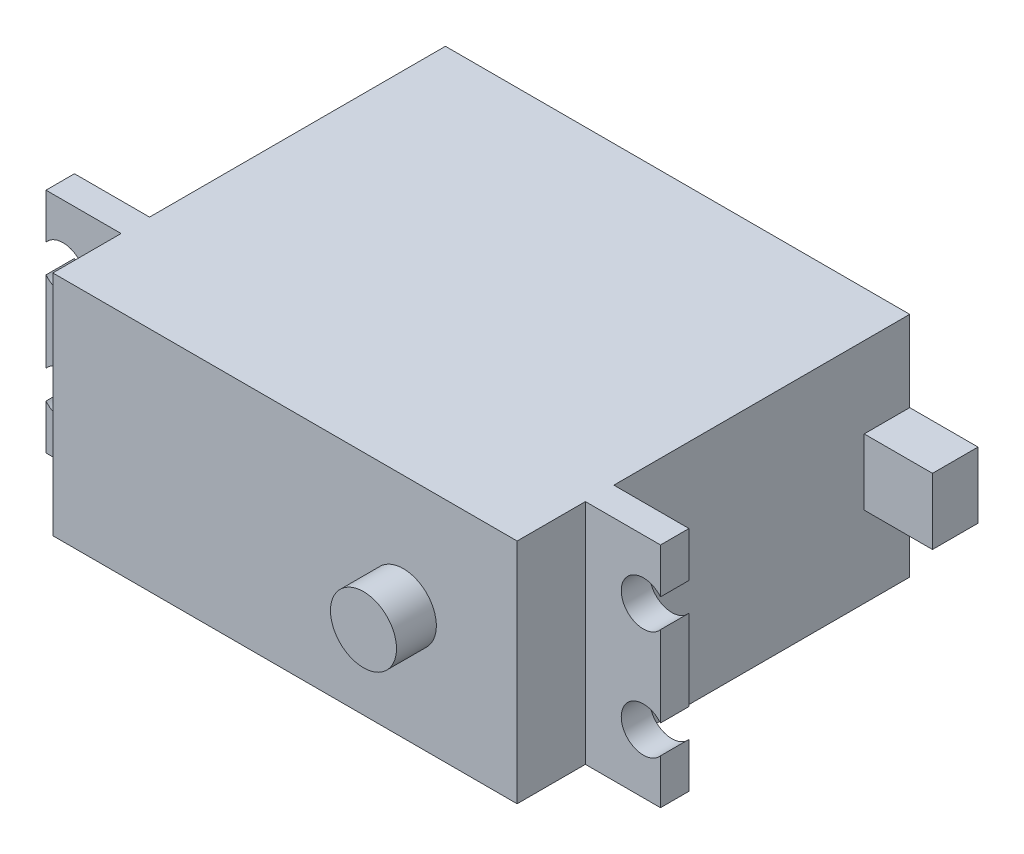
ISO-10303-21;
HEADER;
FILE_DESCRIPTION(('STEP AP214'),'2;1');
FILE_NAME('part.step','',(''),(''),'','','');
FILE_SCHEMA(('AUTOMOTIVE_DESIGN { 1 0 10303 214 1 1 1 1 }'));
ENDSEC;
DATA;
#1=APPLICATION_CONTEXT('core data for automotive mechanical design processes');
#2=APPLICATION_PROTOCOL_DEFINITION('international standard','automotive_design',2000,#1);
#3=PRODUCT_CONTEXT('',#1,'mechanical');
#4=PRODUCT('Part','Part','',(#3));
#5=PRODUCT_RELATED_PRODUCT_CATEGORY('part','',(#4));
#6=PRODUCT_DEFINITION_FORMATION('','',#4);
#7=PRODUCT_DEFINITION_CONTEXT('part definition',#1,'design');
#8=PRODUCT_DEFINITION('design','',#6,#7);
#9=PRODUCT_DEFINITION_SHAPE('','',#8);
#10=(LENGTH_UNIT() NAMED_UNIT(*) SI_UNIT(.MILLI.,.METRE.));
#11=(NAMED_UNIT(*) PLANE_ANGLE_UNIT() SI_UNIT($,.RADIAN.));
#12=(NAMED_UNIT(*) SI_UNIT($,.STERADIAN.) SOLID_ANGLE_UNIT());
#13=UNCERTAINTY_MEASURE_WITH_UNIT(LENGTH_MEASURE(1.E-05),#10,'distance_accuracy_value','');
#14=(GEOMETRIC_REPRESENTATION_CONTEXT(3) GLOBAL_UNCERTAINTY_ASSIGNED_CONTEXT((#13)) GLOBAL_UNIT_ASSIGNED_CONTEXT((#10,
#11,#12)) REPRESENTATION_CONTEXT('',''));
#15=CARTESIAN_POINT('',(0.,0.,0.));
#16=DIRECTION('',(0.,0.,1.));
#17=DIRECTION('',(1.,0.,0.));
#18=AXIS2_PLACEMENT_3D('',#15,#16,#17);
#19=CARTESIAN_POINT('',(20.4,-10.,-26.));
#20=DIRECTION('',(-1.,0.,0.));
#21=DIRECTION('',(0.,0.,1.));
#22=AXIS2_PLACEMENT_3D('',#19,#20,#21);
#23=PLANE('',#22);
#24=DIRECTION('',(0.,0.,1.));
#25=VECTOR('',#24,1.);
#26=CARTESIAN_POINT('',(20.4,2.9,-22.));
#27=LINE('',#26,#25);
#28=CARTESIAN_POINT('',(20.4,2.9,-26.));
#29=VERTEX_POINT('',#28);
#30=CARTESIAN_POINT('',(20.4,2.9,-22.));
#31=VERTEX_POINT('',#30);
#32=EDGE_CURVE('E706',#29,#31,#27,.T.);
#33=ORIENTED_EDGE('',*,*,#32,.F.);
#34=DIRECTION('',(0.,-1.,0.));
#35=VECTOR('',#34,1.);
#36=CARTESIAN_POINT('',(20.4,-10.,-26.));
#37=LINE('',#36,#35);
#38=CARTESIAN_POINT('',(20.4,10.,-26.));
#39=VERTEX_POINT('',#38);
#40=EDGE_CURVE('E215',#39,#29,#37,.T.);
#41=ORIENTED_EDGE('',*,*,#40,.F.);
#42=DIRECTION('',(0.,0.,1.));
#43=VECTOR('',#42,1.);
#44=CARTESIAN_POINT('',(20.4,10.,-26.));
#45=LINE('',#44,#43);
#46=CARTESIAN_POINT('',(20.4,10.,0.));
#47=VERTEX_POINT('',#46);
#48=EDGE_CURVE('E252',#39,#47,#45,.T.);
#49=ORIENTED_EDGE('',*,*,#48,.T.);
#50=DIRECTION('',(0.,-1.,0.));
#51=VECTOR('',#50,1.);
#52=CARTESIAN_POINT('',(20.4,-10.,0.));
#53=LINE('',#52,#51);
#54=CARTESIAN_POINT('',(20.4,-10.,0.));
#55=VERTEX_POINT('',#54);
#56=EDGE_CURVE('E228',#47,#55,#53,.T.);
#57=ORIENTED_EDGE('',*,*,#56,.T.);
#58=DIRECTION('',(0.,0.,1.));
#59=VECTOR('',#58,1.);
#60=CARTESIAN_POINT('',(20.4,-10.,-26.));
#61=LINE('',#60,#59);
#62=CARTESIAN_POINT('',(20.4,-10.,-26.));
#63=VERTEX_POINT('',#62);
#64=EDGE_CURVE('E246',#63,#55,#61,.T.);
#65=ORIENTED_EDGE('',*,*,#64,.F.);
#66=CARTESIAN_POINT('',(20.4,-2.9,-26.));
#67=VERTEX_POINT('',#66);
#68=EDGE_CURVE('E230',#67,#63,#37,.T.);
#69=ORIENTED_EDGE('',*,*,#68,.F.);
#70=DIRECTION('',(0.,0.,-1.));
#71=VECTOR('',#70,1.);
#72=CARTESIAN_POINT('',(20.4,-2.9,-22.));
#73=LINE('',#72,#71);
#74=CARTESIAN_POINT('',(20.4,-2.9,-22.));
#75=VERTEX_POINT('',#74);
#76=EDGE_CURVE('E209',#75,#67,#73,.T.);
#77=ORIENTED_EDGE('',*,*,#76,.F.);
#78=DIRECTION('',(0.,-1.,0.));
#79=VECTOR('',#78,1.);
#80=CARTESIAN_POINT('',(20.4,2.9,-22.));
#81=LINE('',#80,#79);
#82=EDGE_CURVE('E704',#31,#75,#81,.T.);
#83=ORIENTED_EDGE('',*,*,#82,.F.);
#84=EDGE_LOOP('',(#33,#41,#49,#57,#65,#69,#77,#83));
#85=FACE_BOUND('',#84,.T.);
#86=ADVANCED_FACE('F32',(#85),#23,.F.);
#87=CARTESIAN_POINT('',(20.4,10.,8.5));
#88=DIRECTION('',(0.,0.,-1.));
#89=DIRECTION('',(-1.,0.,0.));
#90=AXIS2_PLACEMENT_3D('',#87,#88,#89);
#91=PLANE('',#90);
#92=DIRECTION('',(0.,1.,0.));
#93=VECTOR('',#92,1.);
#94=CARTESIAN_POINT('',(20.4,-10.,8.5));
#95=LINE('',#94,#93);
#96=CARTESIAN_POINT('',(20.4,-10.,8.5));
#97=VERTEX_POINT('',#96);
#98=CARTESIAN_POINT('',(20.4,10.,8.5));
#99=VERTEX_POINT('',#98);
#100=EDGE_CURVE('E276',#97,#99,#95,.T.);
#101=ORIENTED_EDGE('',*,*,#100,.T.);
#102=DIRECTION('',(-1.,0.,0.));
#103=VECTOR('',#102,1.);
#104=CARTESIAN_POINT('',(-20.4,10.,8.5));
#105=LINE('',#104,#103);
#106=CARTESIAN_POINT('',(-20.4,10.,8.5));
#107=VERTEX_POINT('',#106);
#108=EDGE_CURVE('E470',#99,#107,#105,.T.);
#109=ORIENTED_EDGE('',*,*,#108,.T.);
#110=DIRECTION('',(0.,-1.,0.));
#111=VECTOR('',#110,1.);
#112=CARTESIAN_POINT('',(-20.4,-10.,8.5));
#113=LINE('',#112,#111);
#114=CARTESIAN_POINT('',(-20.4,-10.,8.5));
#115=VERTEX_POINT('',#114);
#116=EDGE_CURVE('E438',#107,#115,#113,.T.);
#117=ORIENTED_EDGE('',*,*,#116,.T.);
#118=DIRECTION('',(1.,0.,0.));
#119=VECTOR('',#118,1.);
#120=CARTESIAN_POINT('',(-20.4,-10.,8.5));
#121=LINE('',#120,#119);
#122=EDGE_CURVE('E288',#115,#97,#121,.T.);
#123=ORIENTED_EDGE('',*,*,#122,.T.);
#124=EDGE_LOOP('',(#101,#109,#117,#123));
#125=FACE_BOUND('',#124,.T.);
#126=CARTESIAN_POINT('',(10.4,0.,8.5));
#127=DIRECTION('',(0.,0.,-1.));
#128=DIRECTION('',(-1.,0.,0.));
#129=AXIS2_PLACEMENT_3D('',#126,#127,#128);
#130=CIRCLE('',#129,2.9);
#131=CARTESIAN_POINT('',(7.5,0.,8.5));
#132=VERTEX_POINT('',#131);
#133=EDGE_CURVE('E11',#132,#132,#130,.F.);
#134=ORIENTED_EDGE('',*,*,#133,.F.);
#135=EDGE_LOOP('',(#134));
#136=FACE_BOUND('',#135,.T.);
#137=ADVANCED_FACE('F472',(#125,#136),#91,.F.);
#138=CARTESIAN_POINT('',(27.,10.,0.));
#139=DIRECTION('',(0.,0.,-1.));
#140=DIRECTION('',(-1.,0.,0.));
#141=AXIS2_PLACEMENT_3D('',#138,#139,#140);
#142=PLANE('',#141);
#143=DIRECTION('',(0.,1.,0.));
#144=VECTOR('',#143,1.);
#145=CARTESIAN_POINT('',(-20.4,-10.,0.));
#146=LINE('',#145,#144);
#147=CARTESIAN_POINT('',(-20.4,-10.,0.));
#148=VERTEX_POINT('',#147);
#149=CARTESIAN_POINT('',(-20.4,10.,0.));
#150=VERTEX_POINT('',#149);
#151=EDGE_CURVE('E219',#148,#150,#146,.T.);
#152=ORIENTED_EDGE('',*,*,#151,.F.);
#153=DIRECTION('',(1.,0.,0.));
#154=VECTOR('',#153,1.);
#155=CARTESIAN_POINT('',(-27.,-10.,0.));
#156=LINE('',#155,#154);
#157=CARTESIAN_POINT('',(-27.,-10.,0.));
#158=VERTEX_POINT('',#157);
#159=EDGE_CURVE('E393',#158,#148,#156,.T.);
#160=ORIENTED_EDGE('',*,*,#159,.F.);
#161=DIRECTION('',(0.,-1.,0.));
#162=VECTOR('',#161,1.);
#163=CARTESIAN_POINT('',(-27.,-10.,0.));
#164=LINE('',#163,#162);
#165=CARTESIAN_POINT('',(-27.,-6.04599357943772,0.));
#166=VERTEX_POINT('',#165);
#167=EDGE_CURVE('E400',#166,#158,#164,.T.);
#168=ORIENTED_EDGE('',*,*,#167,.F.);
#169=CARTESIAN_POINT('',(-25.5,-4.8,0.));
#170=DIRECTION('',(0.,0.,-1.));
#171=DIRECTION('',(-1.,0.,0.));
#172=AXIS2_PLACEMENT_3D('',#169,#170,#171);
#173=CIRCLE('',#172,1.95);
#174=CARTESIAN_POINT('',(-27.,-3.55400642056228,0.));
#175=VERTEX_POINT('',#174);
#176=EDGE_CURVE('E332',#166,#175,#173,.F.);
#177=ORIENTED_EDGE('',*,*,#176,.T.);
#178=CARTESIAN_POINT('',(-27.,3.55400642056228,0.));
#179=VERTEX_POINT('',#178);
#180=EDGE_CURVE('E399',#179,#175,#164,.T.);
#181=ORIENTED_EDGE('',*,*,#180,.F.);
#182=CARTESIAN_POINT('',(-25.5,4.8,0.));
#183=DIRECTION('',(0.,0.,-1.));
#184=DIRECTION('',(-1.,0.,0.));
#185=AXIS2_PLACEMENT_3D('',#182,#183,#184);
#186=CIRCLE('',#185,1.95);
#187=CARTESIAN_POINT('',(-27.,6.04599357943772,0.));
#188=VERTEX_POINT('',#187);
#189=EDGE_CURVE('E343',#179,#188,#186,.F.);
#190=ORIENTED_EDGE('',*,*,#189,.T.);
#191=CARTESIAN_POINT('',(-27.,10.,0.));
#192=VERTEX_POINT('',#191);
#193=EDGE_CURVE('E386',#192,#188,#164,.T.);
#194=ORIENTED_EDGE('',*,*,#193,.F.);
#195=DIRECTION('',(-1.,0.,0.));
#196=VECTOR('',#195,1.);
#197=CARTESIAN_POINT('',(-27.,10.,0.));
#198=LINE('',#197,#196);
#199=EDGE_CURVE('E55',#150,#192,#198,.T.);
#200=ORIENTED_EDGE('',*,*,#199,.F.);
#201=EDGE_LOOP('',(#152,#160,#168,#177,#181,#190,#194,#200));
#202=FACE_BOUND('',#201,.T.);
#203=ADVANCED_FACE('F447',(#202),#142,.T.);
#204=CARTESIAN_POINT('',(27.,10.,2.5));
#205=DIRECTION('',(0.,0.,-1.));
#206=DIRECTION('',(-1.,0.,0.));
#207=AXIS2_PLACEMENT_3D('',#204,#205,#206);
#208=PLANE('',#207);
#209=DIRECTION('',(0.,1.,0.));
#210=VECTOR('',#209,1.);
#211=CARTESIAN_POINT('',(20.4,-10.,2.5));
#212=LINE('',#211,#210);
#213=CARTESIAN_POINT('',(20.4,-10.,2.5));
#214=VERTEX_POINT('',#213);
#215=CARTESIAN_POINT('',(20.4,10.,2.5));
#216=VERTEX_POINT('',#215);
#217=EDGE_CURVE('E266',#214,#216,#212,.T.);
#218=ORIENTED_EDGE('',*,*,#217,.F.);
#219=DIRECTION('',(1.,0.,0.));
#220=VECTOR('',#219,1.);
#221=CARTESIAN_POINT('',(-27.,-10.,2.5));
#222=LINE('',#221,#220);
#223=CARTESIAN_POINT('',(27.,-10.,2.5));
#224=VERTEX_POINT('',#223);
#225=EDGE_CURVE('E296',#214,#224,#222,.T.);
#226=ORIENTED_EDGE('',*,*,#225,.T.);
#227=DIRECTION('',(0.,1.,0.));
#228=VECTOR('',#227,1.);
#229=CARTESIAN_POINT('',(27.,-10.,2.5));
#230=LINE('',#229,#228);
#231=CARTESIAN_POINT('',(27.,-6.04599357943771,2.5));
#232=VERTEX_POINT('',#231);
#233=EDGE_CURVE('E353',#224,#232,#230,.T.);
#234=ORIENTED_EDGE('',*,*,#233,.T.);
#235=CARTESIAN_POINT('',(25.5,-4.79999999999999,2.5));
#236=DIRECTION('',(0.,0.,1.));
#237=DIRECTION('',(1.,0.,0.));
#238=AXIS2_PLACEMENT_3D('',#235,#236,#237);
#239=CIRCLE('',#238,1.95);
#240=CARTESIAN_POINT('',(27.,-3.55400642056227,2.5));
#241=VERTEX_POINT('',#240);
#242=EDGE_CURVE('E320',#241,#232,#239,.T.);
#243=ORIENTED_EDGE('',*,*,#242,.F.);
#244=CARTESIAN_POINT('',(27.,3.5540064205623,2.5));
#245=VERTEX_POINT('',#244);
#246=EDGE_CURVE('E357',#241,#245,#230,.T.);
#247=ORIENTED_EDGE('',*,*,#246,.T.);
#248=CARTESIAN_POINT('',(25.5,4.80000000000001,2.5));
#249=DIRECTION('',(0.,0.,1.));
#250=DIRECTION('',(-1.,0.,0.));
#251=AXIS2_PLACEMENT_3D('',#248,#249,#250);
#252=CIRCLE('',#251,1.95);
#253=CARTESIAN_POINT('',(27.,6.04599357943772,2.5));
#254=VERTEX_POINT('',#253);
#255=EDGE_CURVE('E292',#254,#245,#252,.T.);
#256=ORIENTED_EDGE('',*,*,#255,.F.);
#257=CARTESIAN_POINT('',(27.,10.,2.5));
#258=VERTEX_POINT('',#257);
#259=EDGE_CURVE('E358',#254,#258,#230,.T.);
#260=ORIENTED_EDGE('',*,*,#259,.T.);
#261=DIRECTION('',(-1.,0.,0.));
#262=VECTOR('',#261,1.);
#263=CARTESIAN_POINT('',(-27.,10.,2.5));
#264=LINE('',#263,#262);
#265=EDGE_CURVE('E365',#258,#216,#264,.T.);
#266=ORIENTED_EDGE('',*,*,#265,.T.);
#267=EDGE_LOOP('',(#218,#226,#234,#243,#247,#256,#260,#266));
#268=FACE_BOUND('',#267,.T.);
#269=ADVANCED_FACE('F513',(#268),#208,.F.);
#270=DIRECTION('',(0.,-1.,0.));
#271=VECTOR('',#270,1.);
#272=CARTESIAN_POINT('',(-20.4,-10.,2.5));
#273=LINE('',#272,#271);
#274=CARTESIAN_POINT('',(-20.4,10.,2.5));
#275=VERTEX_POINT('',#274);
#276=CARTESIAN_POINT('',(-20.4,-10.,2.5));
#277=VERTEX_POINT('',#276);
#278=EDGE_CURVE('E270',#275,#277,#273,.T.);
#279=ORIENTED_EDGE('',*,*,#278,.F.);
#280=CARTESIAN_POINT('',(-27.,10.,2.5));
#281=VERTEX_POINT('',#280);
#282=EDGE_CURVE('E356',#275,#281,#264,.T.);
#283=ORIENTED_EDGE('',*,*,#282,.T.);
#284=DIRECTION('',(0.,-1.,0.));
#285=VECTOR('',#284,1.);
#286=CARTESIAN_POINT('',(-27.,-10.,2.5));
#287=LINE('',#286,#285);
#288=CARTESIAN_POINT('',(-27.,6.04599357943772,2.5));
#289=VERTEX_POINT('',#288);
#290=EDGE_CURVE('E361',#281,#289,#287,.T.);
#291=ORIENTED_EDGE('',*,*,#290,.T.);
#292=CARTESIAN_POINT('',(-25.5,4.8,2.5));
#293=DIRECTION('',(0.,0.,1.));
#294=DIRECTION('',(1.,0.,0.));
#295=AXIS2_PLACEMENT_3D('',#292,#293,#294);
#296=CIRCLE('',#295,1.95);
#297=CARTESIAN_POINT('',(-27.,3.55400642056228,2.5));
#298=VERTEX_POINT('',#297);
#299=EDGE_CURVE('E341',#298,#289,#296,.T.);
#300=ORIENTED_EDGE('',*,*,#299,.F.);
#301=CARTESIAN_POINT('',(-27.,-3.55400642056228,2.5));
#302=VERTEX_POINT('',#301);
#303=EDGE_CURVE('E423',#298,#302,#287,.T.);
#304=ORIENTED_EDGE('',*,*,#303,.T.);
#305=CARTESIAN_POINT('',(-25.5,-4.8,2.5));
#306=DIRECTION('',(0.,0.,1.));
#307=DIRECTION('',(-1.,0.,0.));
#308=AXIS2_PLACEMENT_3D('',#305,#306,#307);
#309=CIRCLE('',#308,1.95);
#310=CARTESIAN_POINT('',(-27.,-6.04599357943772,2.5));
#311=VERTEX_POINT('',#310);
#312=EDGE_CURVE('E330',#311,#302,#309,.T.);
#313=ORIENTED_EDGE('',*,*,#312,.F.);
#314=CARTESIAN_POINT('',(-27.,-10.,2.5));
#315=VERTEX_POINT('',#314);
#316=EDGE_CURVE('E367',#311,#315,#287,.T.);
#317=ORIENTED_EDGE('',*,*,#316,.T.);
#318=EDGE_CURVE('E383',#315,#277,#222,.T.);
#319=ORIENTED_EDGE('',*,*,#318,.T.);
#320=EDGE_LOOP('',(#279,#283,#291,#300,#304,#313,#317,#319));
#321=FACE_BOUND('',#320,.T.);
#322=ADVANCED_FACE('F429',(#321),#208,.F.);
#323=CARTESIAN_POINT('',(27.,-10.,2.5));
#324=DIRECTION('',(-1.,0.,0.));
#325=DIRECTION('',(0.,0.,1.));
#326=AXIS2_PLACEMENT_3D('',#323,#324,#325);
#327=PLANE('',#326);
#328=DIRECTION('',(0.,1.,0.));
#329=VECTOR('',#328,1.);
#330=CARTESIAN_POINT('',(27.,-10.,0.));
#331=LINE('',#330,#329);
#332=CARTESIAN_POINT('',(27.,-3.55400642056227,0.));
#333=VERTEX_POINT('',#332);
#334=CARTESIAN_POINT('',(27.,3.5540064205623,0.));
#335=VERTEX_POINT('',#334);
#336=EDGE_CURVE('E415',#333,#335,#331,.T.);
#337=ORIENTED_EDGE('',*,*,#336,.T.);
#338=DIRECTION('',(0.,0.,1.));
#339=VECTOR('',#338,1.);
#340=CARTESIAN_POINT('',(27.,3.5540064205623,-5.51543289325507));
#341=LINE('',#340,#339);
#342=EDGE_CURVE('E316',#335,#245,#341,.T.);
#343=ORIENTED_EDGE('',*,*,#342,.T.);
#344=ORIENTED_EDGE('',*,*,#246,.F.);
#345=DIRECTION('',(0.,0.,1.));
#346=VECTOR('',#345,1.);
#347=CARTESIAN_POINT('',(27.,-3.55400642056227,-5.51543289325507));
#348=LINE('',#347,#346);
#349=EDGE_CURVE('E324',#241,#333,#348,.F.);
#350=ORIENTED_EDGE('',*,*,#349,.T.);
#351=EDGE_LOOP('',(#337,#343,#344,#350));
#352=FACE_BOUND('',#351,.T.);
#353=ADVANCED_FACE('F525',(#352),#327,.F.);
#354=CARTESIAN_POINT('',(27.,-10.,0.));
#355=VERTEX_POINT('',#354);
#356=CARTESIAN_POINT('',(27.,-6.04599357943771,0.));
#357=VERTEX_POINT('',#356);
#358=EDGE_CURVE('E410',#355,#357,#331,.T.);
#359=ORIENTED_EDGE('',*,*,#358,.T.);
#360=DIRECTION('',(0.,0.,1.));
#361=VECTOR('',#360,1.);
#362=CARTESIAN_POINT('',(27.,-6.04599357943771,-5.51543289325507));
#363=LINE('',#362,#361);
#364=EDGE_CURVE('E327',#357,#232,#363,.T.);
#365=ORIENTED_EDGE('',*,*,#364,.T.);
#366=ORIENTED_EDGE('',*,*,#233,.F.);
#367=DIRECTION('',(0.,0.,-1.));
#368=VECTOR('',#367,1.);
#369=CARTESIAN_POINT('',(27.,-10.,2.5));
#370=LINE('',#369,#368);
#371=EDGE_CURVE('E380',#224,#355,#370,.T.);
#372=ORIENTED_EDGE('',*,*,#371,.T.);
#373=EDGE_LOOP('',(#359,#365,#366,#372));
#374=FACE_BOUND('',#373,.T.);
#375=ADVANCED_FACE('F464',(#374),#327,.F.);
#376=CARTESIAN_POINT('',(-27.,-10.,2.5));
#377=DIRECTION('',(1.,0.,0.));
#378=DIRECTION('',(0.,0.,-1.));
#379=AXIS2_PLACEMENT_3D('',#376,#377,#378);
#380=PLANE('',#379);
#381=ORIENTED_EDGE('',*,*,#180,.T.);
#382=DIRECTION('',(0.,0.,1.));
#383=VECTOR('',#382,1.);
#384=CARTESIAN_POINT('',(-27.,-3.55400642056228,-5.51543289325507));
#385=LINE('',#384,#383);
#386=EDGE_CURVE('E338',#175,#302,#385,.T.);
#387=ORIENTED_EDGE('',*,*,#386,.T.);
#388=ORIENTED_EDGE('',*,*,#303,.F.);
#389=DIRECTION('',(0.,0.,1.));
#390=VECTOR('',#389,1.);
#391=CARTESIAN_POINT('',(-27.,3.55400642056228,-5.51543289325507));
#392=LINE('',#391,#390);
#393=EDGE_CURVE('E346',#298,#179,#392,.F.);
#394=ORIENTED_EDGE('',*,*,#393,.T.);
#395=EDGE_LOOP('',(#381,#387,#388,#394));
#396=FACE_BOUND('',#395,.T.);
#397=ADVANCED_FACE('F449',(#396),#380,.F.);
#398=ORIENTED_EDGE('',*,*,#193,.T.);
#399=DIRECTION('',(0.,0.,1.));
#400=VECTOR('',#399,1.);
#401=CARTESIAN_POINT('',(-27.,6.04599357943772,-5.51543289325507));
#402=LINE('',#401,#400);
#403=EDGE_CURVE('E349',#188,#289,#402,.T.);
#404=ORIENTED_EDGE('',*,*,#403,.T.);
#405=ORIENTED_EDGE('',*,*,#290,.F.);
#406=DIRECTION('',(0.,0.,-1.));
#407=VECTOR('',#406,1.);
#408=CARTESIAN_POINT('',(-27.,10.,2.5));
#409=LINE('',#408,#407);
#410=EDGE_CURVE('E374',#281,#192,#409,.T.);
#411=ORIENTED_EDGE('',*,*,#410,.T.);
#412=EDGE_LOOP('',(#398,#404,#405,#411));
#413=FACE_BOUND('',#412,.T.);
#414=ADVANCED_FACE('F443',(#413),#380,.F.);
#415=ORIENTED_EDGE('',*,*,#259,.F.);
#416=DIRECTION('',(0.,0.,1.));
#417=VECTOR('',#416,1.);
#418=CARTESIAN_POINT('',(27.,6.04599357943772,-5.51543289325507));
#419=LINE('',#418,#417);
#420=CARTESIAN_POINT('',(27.,6.04599357943772,0.));
#421=VERTEX_POINT('',#420);
#422=EDGE_CURVE('E311',#254,#421,#419,.F.);
#423=ORIENTED_EDGE('',*,*,#422,.T.);
#424=CARTESIAN_POINT('',(27.,10.,0.));
#425=VERTEX_POINT('',#424);
#426=EDGE_CURVE('E352',#421,#425,#331,.T.);
#427=ORIENTED_EDGE('',*,*,#426,.T.);
#428=DIRECTION('',(0.,0.,-1.));
#429=VECTOR('',#428,1.);
#430=CARTESIAN_POINT('',(27.,10.,2.5));
#431=LINE('',#430,#429);
#432=EDGE_CURVE('E371',#258,#425,#431,.T.);
#433=ORIENTED_EDGE('',*,*,#432,.F.);
#434=EDGE_LOOP('',(#415,#423,#427,#433));
#435=FACE_BOUND('',#434,.T.);
#436=ADVANCED_FACE('F34',(#435),#327,.F.);
#437=CARTESIAN_POINT('',(-27.,10.,2.5));
#438=DIRECTION('',(0.,-1.,0.));
#439=DIRECTION('',(0.,0.,-1.));
#440=AXIS2_PLACEMENT_3D('',#437,#438,#439);
#441=PLANE('',#440);
#442=EDGE_CURVE('E403',#425,#47,#198,.T.);
#443=ORIENTED_EDGE('',*,*,#442,.T.);
#444=ORIENTED_EDGE('',*,*,#48,.F.);
#445=DIRECTION('',(1.,0.,0.));
#446=VECTOR('',#445,1.);
#447=CARTESIAN_POINT('',(20.4,10.,-26.));
#448=LINE('',#447,#446);
#449=CARTESIAN_POINT('',(-20.4,10.,-26.));
#450=VERTEX_POINT('',#449);
#451=EDGE_CURVE('E227',#450,#39,#448,.T.);
#452=ORIENTED_EDGE('',*,*,#451,.F.);
#453=DIRECTION('',(0.,0.,1.));
#454=VECTOR('',#453,1.);
#455=CARTESIAN_POINT('',(-20.4,10.,-26.));
#456=LINE('',#455,#454);
#457=EDGE_CURVE('E258',#450,#150,#456,.T.);
#458=ORIENTED_EDGE('',*,*,#457,.T.);
#459=ORIENTED_EDGE('',*,*,#199,.T.);
#460=ORIENTED_EDGE('',*,*,#410,.F.);
#461=ORIENTED_EDGE('',*,*,#282,.F.);
#462=DIRECTION('',(0.,0.,-1.));
#463=VECTOR('',#462,1.);
#464=CARTESIAN_POINT('',(-20.4,10.,8.5));
#465=LINE('',#464,#463);
#466=EDGE_CURVE('E302',#107,#275,#465,.T.);
#467=ORIENTED_EDGE('',*,*,#466,.F.);
#468=ORIENTED_EDGE('',*,*,#108,.F.);
#469=DIRECTION('',(0.,0.,-1.));
#470=VECTOR('',#469,1.);
#471=CARTESIAN_POINT('',(20.4,10.,8.5));
#472=LINE('',#471,#470);
#473=EDGE_CURVE('E307',#99,#216,#472,.T.);
#474=ORIENTED_EDGE('',*,*,#473,.T.);
#475=ORIENTED_EDGE('',*,*,#265,.F.);
#476=ORIENTED_EDGE('',*,*,#432,.T.);
#477=EDGE_LOOP('',(#443,#444,#452,#458,#459,#460,#461,#467,#468,#474,#475,#476));
#478=FACE_BOUND('',#477,.T.);
#479=ADVANCED_FACE('F442',(#478),#441,.F.);
#480=ORIENTED_EDGE('',*,*,#316,.F.);
#481=DIRECTION('',(0.,0.,1.));
#482=VECTOR('',#481,1.);
#483=CARTESIAN_POINT('',(-27.,-6.04599357943772,-5.51543289325507));
#484=LINE('',#483,#482);
#485=EDGE_CURVE('E335',#311,#166,#484,.F.);
#486=ORIENTED_EDGE('',*,*,#485,.T.);
#487=ORIENTED_EDGE('',*,*,#167,.T.);
#488=DIRECTION('',(0.,0.,-1.));
#489=VECTOR('',#488,1.);
#490=CARTESIAN_POINT('',(-27.,-10.,2.5));
#491=LINE('',#490,#489);
#492=EDGE_CURVE('E377',#315,#158,#491,.T.);
#493=ORIENTED_EDGE('',*,*,#492,.F.);
#494=EDGE_LOOP('',(#480,#486,#487,#493));
#495=FACE_BOUND('',#494,.T.);
#496=ADVANCED_FACE('F430',(#495),#380,.F.);
#497=CARTESIAN_POINT('',(-27.,-10.,2.5));
#498=DIRECTION('',(0.,1.,0.));
#499=DIRECTION('',(0.,0.,1.));
#500=AXIS2_PLACEMENT_3D('',#497,#498,#499);
#501=PLANE('',#500);
#502=ORIENTED_EDGE('',*,*,#159,.T.);
#503=DIRECTION('',(0.,0.,1.));
#504=VECTOR('',#503,1.);
#505=CARTESIAN_POINT('',(-20.4,-10.,-26.));
#506=LINE('',#505,#504);
#507=CARTESIAN_POINT('',(-20.4,-10.,-26.));
#508=VERTEX_POINT('',#507);
#509=EDGE_CURVE('E234',#508,#148,#506,.T.);
#510=ORIENTED_EDGE('',*,*,#509,.F.);
#511=DIRECTION('',(-1.,0.,0.));
#512=VECTOR('',#511,1.);
#513=CARTESIAN_POINT('',(20.4,-10.,-26.));
#514=LINE('',#513,#512);
#515=EDGE_CURVE('E232',#63,#508,#514,.T.);
#516=ORIENTED_EDGE('',*,*,#515,.F.);
#517=ORIENTED_EDGE('',*,*,#64,.T.);
#518=EDGE_CURVE('E390',#55,#355,#156,.T.);
#519=ORIENTED_EDGE('',*,*,#518,.T.);
#520=ORIENTED_EDGE('',*,*,#371,.F.);
#521=ORIENTED_EDGE('',*,*,#225,.F.);
#522=DIRECTION('',(0.,0.,-1.));
#523=VECTOR('',#522,1.);
#524=CARTESIAN_POINT('',(20.4,-10.,8.5));
#525=LINE('',#524,#523);
#526=EDGE_CURVE('E283',#97,#214,#525,.T.);
#527=ORIENTED_EDGE('',*,*,#526,.F.);
#528=ORIENTED_EDGE('',*,*,#122,.F.);
#529=DIRECTION('',(0.,0.,-1.));
#530=VECTOR('',#529,1.);
#531=CARTESIAN_POINT('',(-20.4,-10.,8.5));
#532=LINE('',#531,#530);
#533=EDGE_CURVE('E299',#115,#277,#532,.T.);
#534=ORIENTED_EDGE('',*,*,#533,.T.);
#535=ORIENTED_EDGE('',*,*,#318,.F.);
#536=ORIENTED_EDGE('',*,*,#492,.T.);
#537=EDGE_LOOP('',(#502,#510,#516,#517,#519,#520,#521,#527,#528,#534,#535,#536));
#538=FACE_BOUND('',#537,.T.);
#539=ADVANCED_FACE('F431',(#538),#501,.F.);
#540=ORIENTED_EDGE('',*,*,#56,.F.);
#541=ORIENTED_EDGE('',*,*,#442,.F.);
#542=ORIENTED_EDGE('',*,*,#426,.F.);
#543=CARTESIAN_POINT('',(25.5,4.80000000000001,0.));
#544=DIRECTION('',(0.,0.,-1.));
#545=DIRECTION('',(-1.,0.,0.));
#546=AXIS2_PLACEMENT_3D('',#543,#544,#545);
#547=CIRCLE('',#546,1.95);
#548=EDGE_CURVE('E40',#335,#421,#547,.T.);
#549=ORIENTED_EDGE('',*,*,#548,.F.);
#550=ORIENTED_EDGE('',*,*,#336,.F.);
#551=CARTESIAN_POINT('',(25.5,-4.79999999999999,0.));
#552=DIRECTION('',(0.,0.,-1.));
#553=DIRECTION('',(-1.,0.,0.));
#554=AXIS2_PLACEMENT_3D('',#551,#552,#553);
#555=CIRCLE('',#554,1.95);
#556=EDGE_CURVE('E369',#357,#333,#555,.T.);
#557=ORIENTED_EDGE('',*,*,#556,.F.);
#558=ORIENTED_EDGE('',*,*,#358,.F.);
#559=ORIENTED_EDGE('',*,*,#518,.F.);
#560=EDGE_LOOP('',(#540,#541,#542,#549,#550,#557,#558,#559));
#561=FACE_BOUND('',#560,.T.);
#562=ADVANCED_FACE('F459',(#561),#142,.T.);
#563=CARTESIAN_POINT('',(-25.5,4.8,-5.51543289325507));
#564=DIRECTION('',(0.,0.,1.));
#565=DIRECTION('',(1.,0.,0.));
#566=AXIS2_PLACEMENT_3D('',#563,#564,#565);
#567=CYLINDRICAL_SURFACE('',#566,1.95);
#568=ORIENTED_EDGE('',*,*,#189,.F.);
#569=ORIENTED_EDGE('',*,*,#393,.F.);
#570=ORIENTED_EDGE('',*,*,#299,.T.);
#571=ORIENTED_EDGE('',*,*,#403,.F.);
#572=EDGE_LOOP('',(#568,#569,#570,#571));
#573=FACE_BOUND('',#572,.T.);
#574=ADVANCED_FACE('F445',(#573),#567,.F.);
#575=CARTESIAN_POINT('',(-25.5,-4.8,-5.51543289325507));
#576=DIRECTION('',(0.,0.,1.));
#577=DIRECTION('',(1.,0.,0.));
#578=AXIS2_PLACEMENT_3D('',#575,#576,#577);
#579=CYLINDRICAL_SURFACE('',#578,1.95);
#580=ORIENTED_EDGE('',*,*,#176,.F.);
#581=ORIENTED_EDGE('',*,*,#485,.F.);
#582=ORIENTED_EDGE('',*,*,#312,.T.);
#583=ORIENTED_EDGE('',*,*,#386,.F.);
#584=EDGE_LOOP('',(#580,#581,#582,#583));
#585=FACE_BOUND('',#584,.T.);
#586=ADVANCED_FACE('F452',(#585),#579,.F.);
#587=CARTESIAN_POINT('',(25.5,-4.79999999999999,-5.51543289325507));
#588=DIRECTION('',(0.,0.,1.));
#589=DIRECTION('',(1.,0.,0.));
#590=AXIS2_PLACEMENT_3D('',#587,#588,#589);
#591=CYLINDRICAL_SURFACE('',#590,1.95);
#592=ORIENTED_EDGE('',*,*,#556,.T.);
#593=ORIENTED_EDGE('',*,*,#349,.F.);
#594=ORIENTED_EDGE('',*,*,#242,.T.);
#595=ORIENTED_EDGE('',*,*,#364,.F.);
#596=EDGE_LOOP('',(#592,#593,#594,#595));
#597=FACE_BOUND('',#596,.T.);
#598=ADVANCED_FACE('F505',(#597),#591,.F.);
#599=CARTESIAN_POINT('',(25.5,4.80000000000001,-5.51543289325507));
#600=DIRECTION('',(0.,0.,1.));
#601=DIRECTION('',(1.,0.,0.));
#602=AXIS2_PLACEMENT_3D('',#599,#600,#601);
#603=CYLINDRICAL_SURFACE('',#602,1.95);
#604=ORIENTED_EDGE('',*,*,#548,.T.);
#605=ORIENTED_EDGE('',*,*,#422,.F.);
#606=ORIENTED_EDGE('',*,*,#255,.T.);
#607=ORIENTED_EDGE('',*,*,#342,.F.);
#608=EDGE_LOOP('',(#604,#605,#606,#607));
#609=FACE_BOUND('',#608,.T.);
#610=ADVANCED_FACE('F502',(#609),#603,.F.);
#611=CARTESIAN_POINT('',(20.4,-10.,8.5));
#612=DIRECTION('',(-1.,0.,0.));
#613=DIRECTION('',(0.,0.,1.));
#614=AXIS2_PLACEMENT_3D('',#611,#612,#613);
#615=PLANE('',#614);
#616=ORIENTED_EDGE('',*,*,#217,.T.);
#617=ORIENTED_EDGE('',*,*,#473,.F.);
#618=ORIENTED_EDGE('',*,*,#100,.F.);
#619=ORIENTED_EDGE('',*,*,#526,.T.);
#620=EDGE_LOOP('',(#616,#617,#618,#619));
#621=FACE_BOUND('',#620,.T.);
#622=ADVANCED_FACE('F467',(#621),#615,.F.);
#623=CARTESIAN_POINT('',(-20.4,-10.,8.5));
#624=DIRECTION('',(1.,0.,0.));
#625=DIRECTION('',(0.,0.,-1.));
#626=AXIS2_PLACEMENT_3D('',#623,#624,#625);
#627=PLANE('',#626);
#628=ORIENTED_EDGE('',*,*,#278,.T.);
#629=ORIENTED_EDGE('',*,*,#533,.F.);
#630=ORIENTED_EDGE('',*,*,#116,.F.);
#631=ORIENTED_EDGE('',*,*,#466,.T.);
#632=EDGE_LOOP('',(#628,#629,#630,#631));
#633=FACE_BOUND('',#632,.T.);
#634=ADVANCED_FACE('F437',(#633),#627,.F.);
#635=CARTESIAN_POINT('',(-20.4,-10.,-26.));
#636=DIRECTION('',(1.,0.,0.));
#637=DIRECTION('',(0.,0.,-1.));
#638=AXIS2_PLACEMENT_3D('',#635,#636,#637);
#639=PLANE('',#638);
#640=ORIENTED_EDGE('',*,*,#151,.T.);
#641=ORIENTED_EDGE('',*,*,#457,.F.);
#642=DIRECTION('',(0.,1.,0.));
#643=VECTOR('',#642,1.);
#644=CARTESIAN_POINT('',(-20.4,-10.,-26.));
#645=LINE('',#644,#643);
#646=EDGE_CURVE('E225',#508,#450,#645,.T.);
#647=ORIENTED_EDGE('',*,*,#646,.F.);
#648=ORIENTED_EDGE('',*,*,#509,.T.);
#649=EDGE_LOOP('',(#640,#641,#647,#648));
#650=FACE_BOUND('',#649,.T.);
#651=ADVANCED_FACE('F453',(#650),#639,.F.);
#652=CARTESIAN_POINT('',(-20.4,10.,-26.));
#653=DIRECTION('',(0.,0.,1.));
#654=DIRECTION('',(1.,0.,0.));
#655=AXIS2_PLACEMENT_3D('',#652,#653,#654);
#656=PLANE('',#655);
#657=ORIENTED_EDGE('',*,*,#646,.T.);
#658=ORIENTED_EDGE('',*,*,#451,.T.);
#659=ORIENTED_EDGE('',*,*,#40,.T.);
#660=DIRECTION('',(-1.,0.,0.));
#661=VECTOR('',#660,1.);
#662=CARTESIAN_POINT('',(26.4,2.9,-26.));
#663=LINE('',#662,#661);
#664=CARTESIAN_POINT('',(26.4,2.9,-26.));
#665=VERTEX_POINT('',#664);
#666=EDGE_CURVE('E197',#665,#29,#663,.T.);
#667=ORIENTED_EDGE('',*,*,#666,.F.);
#668=DIRECTION('',(0.,1.,0.));
#669=VECTOR('',#668,1.);
#670=CARTESIAN_POINT('',(26.4,2.9,-26.));
#671=LINE('',#670,#669);
#672=CARTESIAN_POINT('',(26.4,-2.9,-26.));
#673=VERTEX_POINT('',#672);
#674=EDGE_CURVE('E204',#673,#665,#671,.T.);
#675=ORIENTED_EDGE('',*,*,#674,.F.);
#676=DIRECTION('',(-1.,0.,0.));
#677=VECTOR('',#676,1.);
#678=CARTESIAN_POINT('',(26.4,-2.9,-26.));
#679=LINE('',#678,#677);
#680=EDGE_CURVE('E47',#673,#67,#679,.T.);
#681=ORIENTED_EDGE('',*,*,#680,.T.);
#682=ORIENTED_EDGE('',*,*,#68,.T.);
#683=ORIENTED_EDGE('',*,*,#515,.T.);
#684=EDGE_LOOP('',(#657,#658,#659,#667,#675,#681,#682,#683));
#685=FACE_BOUND('',#684,.T.);
#686=ADVANCED_FACE('F213',(#685),#656,.F.);
#687=CARTESIAN_POINT('',(10.4,0.,12.));
#688=DIRECTION('',(0.,0.,-1.));
#689=DIRECTION('',(-1.,0.,0.));
#690=AXIS2_PLACEMENT_3D('',#687,#688,#689);
#691=CYLINDRICAL_SURFACE('',#690,2.9);
#692=CARTESIAN_POINT('',(10.4,0.,12.));
#693=DIRECTION('',(0.,0.,1.));
#694=DIRECTION('',(1.,0.,0.));
#695=AXIS2_PLACEMENT_3D('',#692,#693,#694);
#696=CIRCLE('',#695,2.9);
#697=CARTESIAN_POINT('',(13.3,0.,12.));
#698=VERTEX_POINT('',#697);
#699=EDGE_CURVE('E216',#698,#698,#696,.T.);
#700=ORIENTED_EDGE('',*,*,#699,.F.);
#701=EDGE_LOOP('',(#700));
#702=FACE_BOUND('',#701,.T.);
#703=ORIENTED_EDGE('',*,*,#133,.T.);
#704=EDGE_LOOP('',(#703));
#705=FACE_BOUND('',#704,.T.);
#706=ADVANCED_FACE('F478',(#702,#705),#691,.T.);
#707=CARTESIAN_POINT('',(10.4,0.,12.));
#708=DIRECTION('',(0.,0.,1.));
#709=DIRECTION('',(1.,0.,0.));
#710=AXIS2_PLACEMENT_3D('',#707,#708,#709);
#711=PLANE('',#710);
#712=ORIENTED_EDGE('',*,*,#699,.T.);
#713=EDGE_LOOP('',(#712));
#714=FACE_BOUND('',#713,.T.);
#715=ADVANCED_FACE('F480',(#714),#711,.T.);
#716=CARTESIAN_POINT('',(26.4,2.9,-22.));
#717=DIRECTION('',(0.,-1.,0.));
#718=DIRECTION('',(0.,0.,-1.));
#719=AXIS2_PLACEMENT_3D('',#716,#717,#718);
#720=PLANE('',#719);
#721=ORIENTED_EDGE('',*,*,#32,.T.);
#722=DIRECTION('',(-1.,0.,0.));
#723=VECTOR('',#722,1.);
#724=CARTESIAN_POINT('',(26.4,2.9,-22.));
#725=LINE('',#724,#723);
#726=CARTESIAN_POINT('',(26.4,2.9,-22.));
#727=VERTEX_POINT('',#726);
#728=EDGE_CURVE('E200',#727,#31,#725,.T.);
#729=ORIENTED_EDGE('',*,*,#728,.F.);
#730=DIRECTION('',(0.,0.,1.));
#731=VECTOR('',#730,1.);
#732=CARTESIAN_POINT('',(26.4,2.9,-22.));
#733=LINE('',#732,#731);
#734=EDGE_CURVE('E193',#665,#727,#733,.T.);
#735=ORIENTED_EDGE('',*,*,#734,.F.);
#736=ORIENTED_EDGE('',*,*,#666,.T.);
#737=EDGE_LOOP('',(#721,#729,#735,#736));
#738=FACE_BOUND('',#737,.T.);
#739=ADVANCED_FACE('F195',(#738),#720,.F.);
#740=CARTESIAN_POINT('',(26.4,2.9,-22.));
#741=DIRECTION('',(0.,0.,-1.));
#742=DIRECTION('',(-1.,0.,0.));
#743=AXIS2_PLACEMENT_3D('',#740,#741,#742);
#744=PLANE('',#743);
#745=ORIENTED_EDGE('',*,*,#82,.T.);
#746=DIRECTION('',(-1.,0.,0.));
#747=VECTOR('',#746,1.);
#748=CARTESIAN_POINT('',(26.4,-2.9,-22.));
#749=LINE('',#748,#747);
#750=CARTESIAN_POINT('',(26.4,-2.9,-22.));
#751=VERTEX_POINT('',#750);
#752=EDGE_CURVE('E221',#751,#75,#749,.T.);
#753=ORIENTED_EDGE('',*,*,#752,.F.);
#754=DIRECTION('',(0.,-1.,0.));
#755=VECTOR('',#754,1.);
#756=CARTESIAN_POINT('',(26.4,2.9,-22.));
#757=LINE('',#756,#755);
#758=EDGE_CURVE('E203',#727,#751,#757,.T.);
#759=ORIENTED_EDGE('',*,*,#758,.F.);
#760=ORIENTED_EDGE('',*,*,#728,.T.);
#761=EDGE_LOOP('',(#745,#753,#759,#760));
#762=FACE_BOUND('',#761,.T.);
#763=ADVANCED_FACE('F670',(#762),#744,.F.);
#764=CARTESIAN_POINT('',(26.4,-2.9,-22.));
#765=DIRECTION('',(0.,1.,0.));
#766=DIRECTION('',(0.,0.,1.));
#767=AXIS2_PLACEMENT_3D('',#764,#765,#766);
#768=PLANE('',#767);
#769=ORIENTED_EDGE('',*,*,#76,.T.);
#770=ORIENTED_EDGE('',*,*,#680,.F.);
#771=DIRECTION('',(0.,0.,-1.));
#772=VECTOR('',#771,1.);
#773=CARTESIAN_POINT('',(26.4,-2.9,-22.));
#774=LINE('',#773,#772);
#775=EDGE_CURVE('E208',#751,#673,#774,.T.);
#776=ORIENTED_EDGE('',*,*,#775,.F.);
#777=ORIENTED_EDGE('',*,*,#752,.T.);
#778=EDGE_LOOP('',(#769,#770,#776,#777));
#779=FACE_BOUND('',#778,.T.);
#780=ADVANCED_FACE('F679',(#779),#768,.F.);
#781=CARTESIAN_POINT('',(26.4,-2.9,-26.));
#782=DIRECTION('',(1.,0.,0.));
#783=DIRECTION('',(0.,0.,-1.));
#784=AXIS2_PLACEMENT_3D('',#781,#782,#783);
#785=PLANE('',#784);
#786=ORIENTED_EDGE('',*,*,#674,.T.);
#787=ORIENTED_EDGE('',*,*,#734,.T.);
#788=ORIENTED_EDGE('',*,*,#758,.T.);
#789=ORIENTED_EDGE('',*,*,#775,.T.);
#790=EDGE_LOOP('',(#786,#787,#788,#789));
#791=FACE_BOUND('',#790,.T.);
#792=ADVANCED_FACE('F206',(#791),#785,.T.);
#793=CLOSED_SHELL('',(#86,#137,#203,#269,#322,#353,#375,#397,#414,#436,#479,#496,#539,#562,#574,
#586,#598,#610,#622,#634,#651,#686,#706,#715,#739,#763,#780,#792));
#794=MANIFOLD_SOLID_BREP('B2',#793);
#795=ADVANCED_BREP_SHAPE_REPRESENTATION('',(#18,#794),#14);
#796=SHAPE_DEFINITION_REPRESENTATION(#9,#795);
ENDSEC;
END-ISO-10303-21;
